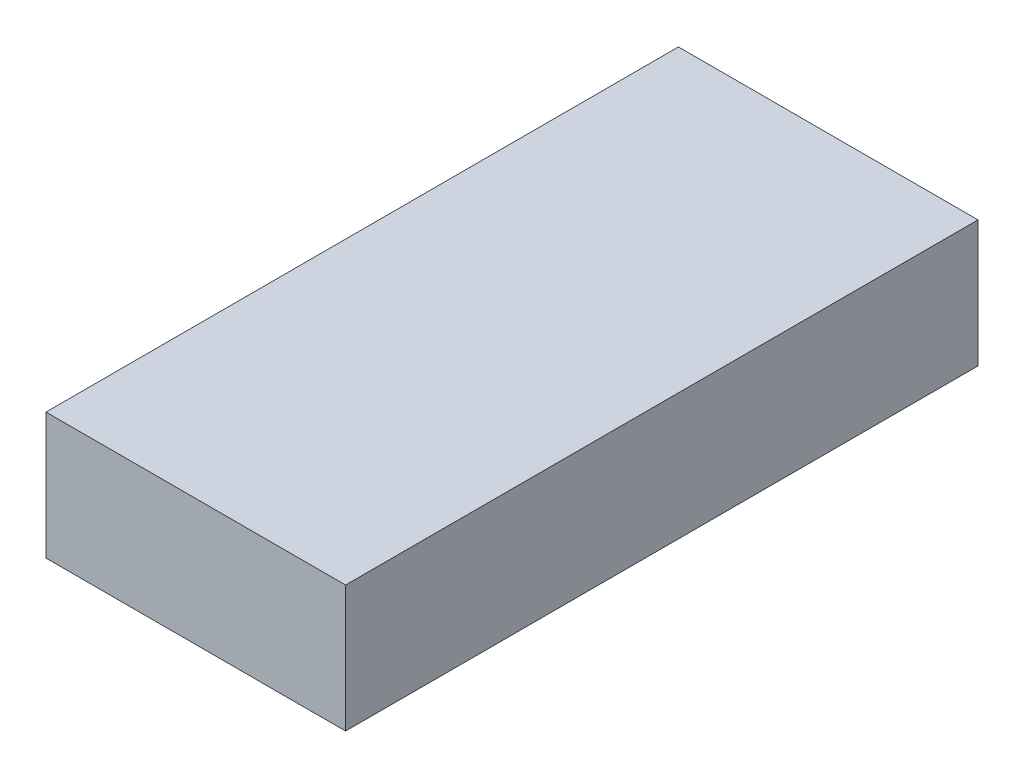
ISO-10303-21;
HEADER;
FILE_DESCRIPTION(('STEP AP214'),'2;1');
FILE_NAME('part.step','',(''),(''),'','','');
FILE_SCHEMA(('AUTOMOTIVE_DESIGN { 1 0 10303 214 1 1 1 1 }'));
ENDSEC;
DATA;
#1=APPLICATION_CONTEXT('core data for automotive mechanical design processes');
#2=APPLICATION_PROTOCOL_DEFINITION('international standard','automotive_design',2000,#1);
#3=PRODUCT_CONTEXT('',#1,'mechanical');
#4=PRODUCT('Part','Part','',(#3));
#5=PRODUCT_RELATED_PRODUCT_CATEGORY('part','',(#4));
#6=PRODUCT_DEFINITION_FORMATION('','',#4);
#7=PRODUCT_DEFINITION_CONTEXT('part definition',#1,'design');
#8=PRODUCT_DEFINITION('design','',#6,#7);
#9=PRODUCT_DEFINITION_SHAPE('','',#8);
#10=(LENGTH_UNIT() NAMED_UNIT(*) SI_UNIT(.MILLI.,.METRE.));
#11=(NAMED_UNIT(*) PLANE_ANGLE_UNIT() SI_UNIT($,.RADIAN.));
#12=(NAMED_UNIT(*) SI_UNIT($,.STERADIAN.) SOLID_ANGLE_UNIT());
#13=UNCERTAINTY_MEASURE_WITH_UNIT(LENGTH_MEASURE(1.E-05),#10,'distance_accuracy_value','');
#14=(GEOMETRIC_REPRESENTATION_CONTEXT(3) GLOBAL_UNCERTAINTY_ASSIGNED_CONTEXT((#13)) GLOBAL_UNIT_ASSIGNED_CONTEXT((#10,
#11,#12)) REPRESENTATION_CONTEXT('',''));
#15=CARTESIAN_POINT('',(0.,0.,0.));
#16=DIRECTION('',(0.,0.,1.));
#17=DIRECTION('',(1.,0.,0.));
#18=AXIS2_PLACEMENT_3D('',#15,#16,#17);
#19=CARTESIAN_POINT('',(-699.622641509434,380.,-483.962264150943));
#20=DIRECTION('',(1.,0.,0.));
#21=DIRECTION('',(0.,0.,-1.));
#22=AXIS2_PLACEMENT_3D('',#19,#20,#21);
#23=PLANE('',#22);
#24=DIRECTION('',(0.,0.,1.));
#25=VECTOR('',#24,1.);
#26=CARTESIAN_POINT('',(-699.622641509434,0.,-483.962264150943));
#27=LINE('',#26,#25);
#28=CARTESIAN_POINT('',(-699.622641509434,0.,-483.962264150943));
#29=VERTEX_POINT('',#28);
#30=CARTESIAN_POINT('',(-699.622641509433,0.,1416.03773584906));
#31=VERTEX_POINT('',#30);
#32=EDGE_CURVE('E107',#29,#31,#27,.T.);
#33=ORIENTED_EDGE('',*,*,#32,.T.);
#34=DIRECTION('',(0.,-1.,0.));
#35=VECTOR('',#34,1.);
#36=CARTESIAN_POINT('',(-699.622641509433,380.,1416.03773584906));
#37=LINE('',#36,#35);
#38=CARTESIAN_POINT('',(-699.622641509433,380.,1416.03773584906));
#39=VERTEX_POINT('',#38);
#40=EDGE_CURVE('E11',#39,#31,#37,.T.);
#41=ORIENTED_EDGE('',*,*,#40,.F.);
#42=DIRECTION('',(0.,0.,1.));
#43=VECTOR('',#42,1.);
#44=CARTESIAN_POINT('',(-699.622641509434,380.,-483.962264150943));
#45=LINE('',#44,#43);
#46=CARTESIAN_POINT('',(-699.622641509434,380.,-483.962264150943));
#47=VERTEX_POINT('',#46);
#48=EDGE_CURVE('E91',#47,#39,#45,.T.);
#49=ORIENTED_EDGE('',*,*,#48,.F.);
#50=DIRECTION('',(0.,-1.,0.));
#51=VECTOR('',#50,1.);
#52=CARTESIAN_POINT('',(-699.622641509434,380.,-483.962264150943));
#53=LINE('',#52,#51);
#54=EDGE_CURVE('E103',#47,#29,#53,.T.);
#55=ORIENTED_EDGE('',*,*,#54,.T.);
#56=EDGE_LOOP('',(#33,#41,#49,#55));
#57=FACE_BOUND('',#56,.T.);
#58=ADVANCED_FACE('F39',(#57),#23,.F.);
#59=CARTESIAN_POINT('',(-699.622641509433,380.,1416.03773584906));
#60=DIRECTION('',(0.,0.,-1.));
#61=DIRECTION('',(-1.,0.,0.));
#62=AXIS2_PLACEMENT_3D('',#59,#60,#61);
#63=PLANE('',#62);
#64=DIRECTION('',(1.,0.,0.));
#65=VECTOR('',#64,1.);
#66=CARTESIAN_POINT('',(-699.622641509433,0.,1416.03773584906));
#67=LINE('',#66,#65);
#68=CARTESIAN_POINT('',(200.377358490567,0.,1416.03773584906));
#69=VERTEX_POINT('',#68);
#70=EDGE_CURVE('E96',#31,#69,#67,.T.);
#71=ORIENTED_EDGE('',*,*,#70,.T.);
#72=DIRECTION('',(0.,-1.,0.));
#73=VECTOR('',#72,1.);
#74=CARTESIAN_POINT('',(200.377358490567,380.,1416.03773584906));
#75=LINE('',#74,#73);
#76=CARTESIAN_POINT('',(200.377358490567,380.,1416.03773584906));
#77=VERTEX_POINT('',#76);
#78=EDGE_CURVE('E48',#77,#69,#75,.T.);
#79=ORIENTED_EDGE('',*,*,#78,.F.);
#80=DIRECTION('',(1.,0.,0.));
#81=VECTOR('',#80,1.);
#82=CARTESIAN_POINT('',(-699.622641509433,380.,1416.03773584906));
#83=LINE('',#82,#81);
#84=EDGE_CURVE('E86',#39,#77,#83,.T.);
#85=ORIENTED_EDGE('',*,*,#84,.F.);
#86=ORIENTED_EDGE('',*,*,#40,.T.);
#87=EDGE_LOOP('',(#71,#79,#85,#86));
#88=FACE_BOUND('',#87,.T.);
#89=ADVANCED_FACE('F95',(#88),#63,.F.);
#90=CARTESIAN_POINT('',(200.377358490566,380.,-483.962264150943));
#91=DIRECTION('',(-1.,0.,0.));
#92=DIRECTION('',(0.,0.,1.));
#93=AXIS2_PLACEMENT_3D('',#90,#91,#92);
#94=PLANE('',#93);
#95=DIRECTION('',(0.,0.,-1.));
#96=VECTOR('',#95,1.);
#97=CARTESIAN_POINT('',(200.377358490566,0.,-483.962264150943));
#98=LINE('',#97,#96);
#99=CARTESIAN_POINT('',(200.377358490566,0.,-483.962264150943));
#100=VERTEX_POINT('',#99);
#101=EDGE_CURVE('E73',#69,#100,#98,.T.);
#102=ORIENTED_EDGE('',*,*,#101,.T.);
#103=DIRECTION('',(0.,-1.,0.));
#104=VECTOR('',#103,1.);
#105=CARTESIAN_POINT('',(200.377358490566,380.,-483.962264150943));
#106=LINE('',#105,#104);
#107=CARTESIAN_POINT('',(200.377358490566,380.,-483.962264150943));
#108=VERTEX_POINT('',#107);
#109=EDGE_CURVE('E98',#108,#100,#106,.T.);
#110=ORIENTED_EDGE('',*,*,#109,.F.);
#111=DIRECTION('',(0.,0.,-1.));
#112=VECTOR('',#111,1.);
#113=CARTESIAN_POINT('',(200.377358490566,380.,-483.962264150943));
#114=LINE('',#113,#112);
#115=EDGE_CURVE('E89',#77,#108,#114,.T.);
#116=ORIENTED_EDGE('',*,*,#115,.F.);
#117=ORIENTED_EDGE('',*,*,#78,.T.);
#118=EDGE_LOOP('',(#102,#110,#116,#117));
#119=FACE_BOUND('',#118,.T.);
#120=ADVANCED_FACE('F99',(#119),#94,.F.);
#121=CARTESIAN_POINT('',(-699.622641509434,380.,-483.962264150943));
#122=DIRECTION('',(0.,0.,1.));
#123=DIRECTION('',(1.,0.,0.));
#124=AXIS2_PLACEMENT_3D('',#121,#122,#123);
#125=PLANE('',#124);
#126=DIRECTION('',(-1.,0.,0.));
#127=VECTOR('',#126,1.);
#128=CARTESIAN_POINT('',(-699.622641509434,0.,-483.962264150943));
#129=LINE('',#128,#127);
#130=EDGE_CURVE('E79',#100,#29,#129,.T.);
#131=ORIENTED_EDGE('',*,*,#130,.T.);
#132=ORIENTED_EDGE('',*,*,#54,.F.);
#133=DIRECTION('',(-1.,0.,0.));
#134=VECTOR('',#133,1.);
#135=CARTESIAN_POINT('',(-699.622641509434,380.,-483.962264150943));
#136=LINE('',#135,#134);
#137=EDGE_CURVE('E56',#108,#47,#136,.T.);
#138=ORIENTED_EDGE('',*,*,#137,.F.);
#139=ORIENTED_EDGE('',*,*,#109,.T.);
#140=EDGE_LOOP('',(#131,#132,#138,#139));
#141=FACE_BOUND('',#140,.T.);
#142=ADVANCED_FACE('F120',(#141),#125,.F.);
#143=CARTESIAN_POINT('',(0.,380.,0.));
#144=DIRECTION('',(0.,1.,0.));
#145=DIRECTION('',(0.,0.,1.));
#146=AXIS2_PLACEMENT_3D('',#143,#144,#145);
#147=PLANE('',#146);
#148=ORIENTED_EDGE('',*,*,#48,.T.);
#149=ORIENTED_EDGE('',*,*,#84,.T.);
#150=ORIENTED_EDGE('',*,*,#115,.T.);
#151=ORIENTED_EDGE('',*,*,#137,.T.);
#152=EDGE_LOOP('',(#148,#149,#150,#151));
#153=FACE_BOUND('',#152,.T.);
#154=ADVANCED_FACE('F87',(#153),#147,.T.);
#155=CARTESIAN_POINT('',(0.,0.,0.));
#156=DIRECTION('',(0.,1.,0.));
#157=DIRECTION('',(0.,0.,1.));
#158=AXIS2_PLACEMENT_3D('',#155,#156,#157);
#159=PLANE('',#158);
#160=ORIENTED_EDGE('',*,*,#32,.F.);
#161=ORIENTED_EDGE('',*,*,#130,.F.);
#162=ORIENTED_EDGE('',*,*,#101,.F.);
#163=ORIENTED_EDGE('',*,*,#70,.F.);
#164=EDGE_LOOP('',(#160,#161,#162,#163));
#165=FACE_BOUND('',#164,.T.);
#166=ADVANCED_FACE('F123',(#165),#159,.F.);
#167=CLOSED_SHELL('',(#58,#89,#120,#142,#154,#166));
#168=MANIFOLD_SOLID_BREP('B2',#167);
#169=ADVANCED_BREP_SHAPE_REPRESENTATION('',(#18,#168),#14);
#170=SHAPE_DEFINITION_REPRESENTATION(#9,#169);
ENDSEC;
END-ISO-10303-21;
